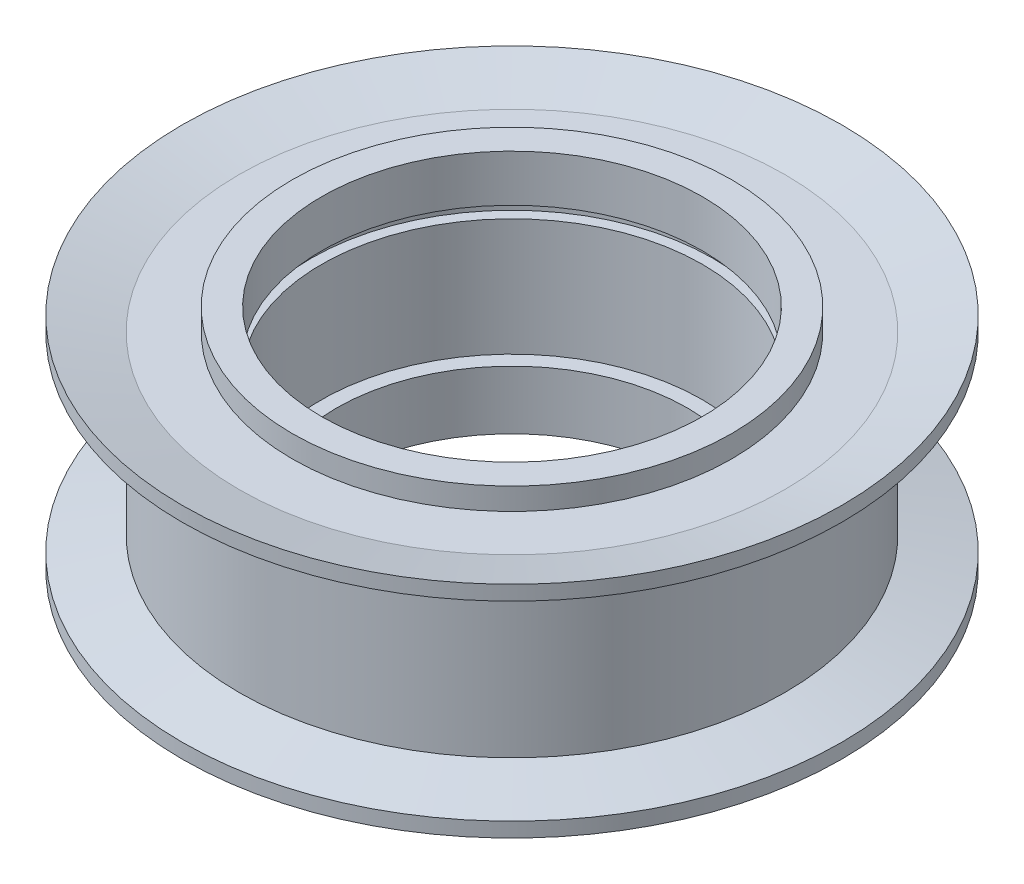
ISO-10303-21;
HEADER;
FILE_DESCRIPTION(('STEP AP214'),'2;1');
FILE_NAME('part.step','',(''),(''),'','','');
FILE_SCHEMA(('AUTOMOTIVE_DESIGN { 1 0 10303 214 1 1 1 1 }'));
ENDSEC;
DATA;
#1=APPLICATION_CONTEXT('core data for automotive mechanical design processes');
#2=APPLICATION_PROTOCOL_DEFINITION('international standard','automotive_design',2000,#1);
#3=PRODUCT_CONTEXT('',#1,'mechanical');
#4=PRODUCT('Part','Part','',(#3));
#5=PRODUCT_RELATED_PRODUCT_CATEGORY('part','',(#4));
#6=PRODUCT_DEFINITION_FORMATION('','',#4);
#7=PRODUCT_DEFINITION_CONTEXT('part definition',#1,'design');
#8=PRODUCT_DEFINITION('design','',#6,#7);
#9=PRODUCT_DEFINITION_SHAPE('','',#8);
#10=(LENGTH_UNIT() NAMED_UNIT(*) SI_UNIT(.MILLI.,.METRE.));
#11=(NAMED_UNIT(*) PLANE_ANGLE_UNIT() SI_UNIT($,.RADIAN.));
#12=(NAMED_UNIT(*) SI_UNIT($,.STERADIAN.) SOLID_ANGLE_UNIT());
#13=UNCERTAINTY_MEASURE_WITH_UNIT(LENGTH_MEASURE(1.E-05),#10,'distance_accuracy_value','');
#14=(GEOMETRIC_REPRESENTATION_CONTEXT(3) GLOBAL_UNCERTAINTY_ASSIGNED_CONTEXT((#13)) GLOBAL_UNIT_ASSIGNED_CONTEXT((#10,
#11,#12)) REPRESENTATION_CONTEXT('',''));
#15=CARTESIAN_POINT('',(0.,0.,0.));
#16=DIRECTION('',(0.,0.,1.));
#17=DIRECTION('',(1.,0.,0.));
#18=AXIS2_PLACEMENT_3D('',#15,#16,#17);
#19=CARTESIAN_POINT('',(0.,49.340027700831,0.));
#20=DIRECTION('',(0.,1.,0.));
#21=DIRECTION('',(0.,0.,1.));
#22=AXIS2_PLACEMENT_3D('',#19,#20,#21);
#23=CYLINDRICAL_SURFACE('',#22,15.);
#24=CARTESIAN_POINT('',(0.,8.,0.));
#25=DIRECTION('',(0.,1.,0.));
#26=DIRECTION('',(0.,0.,1.));
#27=AXIS2_PLACEMENT_3D('',#24,#25,#26);
#28=CIRCLE('',#27,15.);
#29=CARTESIAN_POINT('',(0.,8.,15.));
#30=VERTEX_POINT('',#29);
#31=EDGE_CURVE('E73',#30,#30,#28,.T.);
#32=ORIENTED_EDGE('',*,*,#31,.F.);
#33=EDGE_LOOP('',(#32));
#34=FACE_BOUND('',#33,.T.);
#35=CARTESIAN_POINT('',(0.,6.50000000000001,0.));
#36=DIRECTION('',(0.,-1.,0.));
#37=DIRECTION('',(1.,0.,0.));
#38=AXIS2_PLACEMENT_3D('',#35,#36,#37);
#39=CIRCLE('',#38,15.);
#40=CARTESIAN_POINT('',(15.,6.50000000000001,0.));
#41=VERTEX_POINT('',#40);
#42=EDGE_CURVE('E10',#41,#41,#39,.T.);
#43=ORIENTED_EDGE('',*,*,#42,.F.);
#44=EDGE_LOOP('',(#43));
#45=FACE_BOUND('',#44,.T.);
#46=ADVANCED_FACE('F32',(#34,#45),#23,.T.);
#47=CARTESIAN_POINT('',(0.,49.340027700831,0.));
#48=DIRECTION('',(0.,1.,0.));
#49=DIRECTION('',(0.,0.,1.));
#50=AXIS2_PLACEMENT_3D('',#47,#48,#49);
#51=CYLINDRICAL_SURFACE('',#50,15.);
#52=CARTESIAN_POINT('',(0.,-8.,0.));
#53=DIRECTION('',(0.,1.,0.));
#54=DIRECTION('',(0.,0.,1.));
#55=AXIS2_PLACEMENT_3D('',#52,#53,#54);
#56=CIRCLE('',#55,15.);
#57=CARTESIAN_POINT('',(0.,-8.,15.));
#58=VERTEX_POINT('',#57);
#59=EDGE_CURVE('E67',#58,#58,#56,.T.);
#60=ORIENTED_EDGE('',*,*,#59,.T.);
#61=EDGE_LOOP('',(#60));
#62=FACE_BOUND('',#61,.T.);
#63=CARTESIAN_POINT('',(0.,-6.50000000000001,0.));
#64=DIRECTION('',(0.,1.,0.));
#65=DIRECTION('',(-1.,0.,0.));
#66=AXIS2_PLACEMENT_3D('',#63,#64,#65);
#67=CIRCLE('',#66,15.);
#68=CARTESIAN_POINT('',(-15.,-6.50000000000001,0.));
#69=VERTEX_POINT('',#68);
#70=EDGE_CURVE('E39',#69,#69,#67,.T.);
#71=ORIENTED_EDGE('',*,*,#70,.F.);
#72=EDGE_LOOP('',(#71));
#73=FACE_BOUND('',#72,.T.);
#74=ADVANCED_FACE('F115',(#62,#73),#51,.T.);
#75=CARTESIAN_POINT('',(0.,49.340027700831,0.));
#76=DIRECTION('',(0.,1.,0.));
#77=DIRECTION('',(0.,0.,1.));
#78=AXIS2_PLACEMENT_3D('',#75,#76,#77);
#79=CYLINDRICAL_SURFACE('',#78,13.);
#80=CARTESIAN_POINT('',(0.,4.8,0.));
#81=DIRECTION('',(0.,1.,0.));
#82=DIRECTION('',(0.,0.,1.));
#83=AXIS2_PLACEMENT_3D('',#80,#81,#82);
#84=CIRCLE('',#83,13.);
#85=CARTESIAN_POINT('',(0.,4.8,13.));
#86=VERTEX_POINT('',#85);
#87=EDGE_CURVE('E43',#86,#86,#84,.T.);
#88=ORIENTED_EDGE('',*,*,#87,.F.);
#89=EDGE_LOOP('',(#88));
#90=FACE_BOUND('',#89,.T.);
#91=CARTESIAN_POINT('',(0.,8.,0.));
#92=DIRECTION('',(0.,1.,0.));
#93=DIRECTION('',(0.,0.,1.));
#94=AXIS2_PLACEMENT_3D('',#91,#92,#93);
#95=CIRCLE('',#94,13.);
#96=CARTESIAN_POINT('',(0.,8.,13.));
#97=VERTEX_POINT('',#96);
#98=EDGE_CURVE('E76',#97,#97,#95,.T.);
#99=ORIENTED_EDGE('',*,*,#98,.T.);
#100=EDGE_LOOP('',(#99));
#101=FACE_BOUND('',#100,.T.);
#102=ADVANCED_FACE('F34',(#90,#101),#79,.F.);
#103=CARTESIAN_POINT('',(13.,4.8,0.));
#104=DIRECTION('',(0.,1.,0.));
#105=DIRECTION('',(0.,0.,1.));
#106=AXIS2_PLACEMENT_3D('',#103,#104,#105);
#107=PLANE('',#106);
#108=CARTESIAN_POINT('',(0.,4.8,0.));
#109=DIRECTION('',(0.,1.,0.));
#110=DIRECTION('',(0.,0.,1.));
#111=AXIS2_PLACEMENT_3D('',#108,#109,#110);
#112=CIRCLE('',#111,13.7129491325254);
#113=CARTESIAN_POINT('',(0.,4.8,13.7129491325254));
#114=VERTEX_POINT('',#113);
#115=EDGE_CURVE('E47',#114,#114,#112,.T.);
#116=ORIENTED_EDGE('',*,*,#115,.F.);
#117=EDGE_LOOP('',(#116));
#118=FACE_BOUND('',#117,.T.);
#119=ORIENTED_EDGE('',*,*,#87,.T.);
#120=EDGE_LOOP('',(#119));
#121=FACE_BOUND('',#120,.T.);
#122=ADVANCED_FACE('F155',(#118,#121),#107,.F.);
#123=CARTESIAN_POINT('',(0.,49.340027700831,0.));
#124=DIRECTION('',(0.,1.,0.));
#125=DIRECTION('',(0.,0.,1.));
#126=AXIS2_PLACEMENT_3D('',#123,#124,#125);
#127=CYLINDRICAL_SURFACE('',#126,13.7129491325254);
#128=CARTESIAN_POINT('',(0.,4.,0.));
#129=DIRECTION('',(0.,1.,0.));
#130=DIRECTION('',(0.,0.,1.));
#131=AXIS2_PLACEMENT_3D('',#128,#129,#130);
#132=CIRCLE('',#131,13.7129491325254);
#133=CARTESIAN_POINT('',(0.,4.,13.7129491325254));
#134=VERTEX_POINT('',#133);
#135=EDGE_CURVE('E52',#134,#134,#132,.T.);
#136=ORIENTED_EDGE('',*,*,#135,.F.);
#137=EDGE_LOOP('',(#136));
#138=FACE_BOUND('',#137,.T.);
#139=ORIENTED_EDGE('',*,*,#115,.T.);
#140=EDGE_LOOP('',(#139));
#141=FACE_BOUND('',#140,.T.);
#142=ADVANCED_FACE('F152',(#138,#141),#127,.F.);
#143=CARTESIAN_POINT('',(13.,4.,0.));
#144=DIRECTION('',(0.,-1.,0.));
#145=DIRECTION('',(0.,0.,-1.));
#146=AXIS2_PLACEMENT_3D('',#143,#144,#145);
#147=PLANE('',#146);
#148=CARTESIAN_POINT('',(0.,4.,0.));
#149=DIRECTION('',(0.,1.,0.));
#150=DIRECTION('',(0.,0.,1.));
#151=AXIS2_PLACEMENT_3D('',#148,#149,#150);
#152=CIRCLE('',#151,13.);
#153=CARTESIAN_POINT('',(0.,4.,13.));
#154=VERTEX_POINT('',#153);
#155=EDGE_CURVE('E55',#154,#154,#152,.T.);
#156=ORIENTED_EDGE('',*,*,#155,.F.);
#157=EDGE_LOOP('',(#156));
#158=FACE_BOUND('',#157,.T.);
#159=ORIENTED_EDGE('',*,*,#135,.T.);
#160=EDGE_LOOP('',(#159));
#161=FACE_BOUND('',#160,.T.);
#162=ADVANCED_FACE('F148',(#158,#161),#147,.F.);
#163=CARTESIAN_POINT('',(0.,49.340027700831,0.));
#164=DIRECTION('',(0.,1.,0.));
#165=DIRECTION('',(0.,0.,1.));
#166=AXIS2_PLACEMENT_3D('',#163,#164,#165);
#167=CYLINDRICAL_SURFACE('',#166,13.);
#168=CARTESIAN_POINT('',(0.,-4.,0.));
#169=DIRECTION('',(0.,1.,0.));
#170=DIRECTION('',(0.,0.,1.));
#171=AXIS2_PLACEMENT_3D('',#168,#169,#170);
#172=CIRCLE('',#171,13.);
#173=CARTESIAN_POINT('',(0.,-4.,13.));
#174=VERTEX_POINT('',#173);
#175=EDGE_CURVE('E58',#174,#174,#172,.T.);
#176=ORIENTED_EDGE('',*,*,#175,.F.);
#177=EDGE_LOOP('',(#176));
#178=FACE_BOUND('',#177,.T.);
#179=ORIENTED_EDGE('',*,*,#155,.T.);
#180=EDGE_LOOP('',(#179));
#181=FACE_BOUND('',#180,.T.);
#182=ADVANCED_FACE('F144',(#178,#181),#167,.F.);
#183=CARTESIAN_POINT('',(12.,-4.,0.));
#184=DIRECTION('',(0.,-1.,0.));
#185=DIRECTION('',(0.,0.,-1.));
#186=AXIS2_PLACEMENT_3D('',#183,#184,#185);
#187=PLANE('',#186);
#188=CARTESIAN_POINT('',(0.,-4.,0.));
#189=DIRECTION('',(0.,1.,0.));
#190=DIRECTION('',(0.,0.,1.));
#191=AXIS2_PLACEMENT_3D('',#188,#189,#190);
#192=CIRCLE('',#191,12.);
#193=CARTESIAN_POINT('',(0.,-4.,12.));
#194=VERTEX_POINT('',#193);
#195=EDGE_CURVE('E61',#194,#194,#192,.T.);
#196=ORIENTED_EDGE('',*,*,#195,.F.);
#197=EDGE_LOOP('',(#196));
#198=FACE_BOUND('',#197,.T.);
#199=ORIENTED_EDGE('',*,*,#175,.T.);
#200=EDGE_LOOP('',(#199));
#201=FACE_BOUND('',#200,.T.);
#202=ADVANCED_FACE('F140',(#198,#201),#187,.F.);
#203=CARTESIAN_POINT('',(0.,49.340027700831,0.));
#204=DIRECTION('',(0.,1.,0.));
#205=DIRECTION('',(0.,0.,1.));
#206=AXIS2_PLACEMENT_3D('',#203,#204,#205);
#207=CYLINDRICAL_SURFACE('',#206,12.);
#208=CARTESIAN_POINT('',(0.,-8.,0.));
#209=DIRECTION('',(0.,1.,0.));
#210=DIRECTION('',(0.,0.,1.));
#211=AXIS2_PLACEMENT_3D('',#208,#209,#210);
#212=CIRCLE('',#211,12.);
#213=CARTESIAN_POINT('',(0.,-8.,12.));
#214=VERTEX_POINT('',#213);
#215=EDGE_CURVE('E64',#214,#214,#212,.T.);
#216=ORIENTED_EDGE('',*,*,#215,.F.);
#217=EDGE_LOOP('',(#216));
#218=FACE_BOUND('',#217,.T.);
#219=ORIENTED_EDGE('',*,*,#195,.T.);
#220=EDGE_LOOP('',(#219));
#221=FACE_BOUND('',#220,.T.);
#222=ADVANCED_FACE('F136',(#218,#221),#207,.F.);
#223=CARTESIAN_POINT('',(15.,-8.,0.));
#224=DIRECTION('',(0.,1.,0.));
#225=DIRECTION('',(0.,0.,1.));
#226=AXIS2_PLACEMENT_3D('',#223,#224,#225);
#227=PLANE('',#226);
#228=ORIENTED_EDGE('',*,*,#59,.F.);
#229=EDGE_LOOP('',(#228));
#230=FACE_BOUND('',#229,.T.);
#231=ORIENTED_EDGE('',*,*,#215,.T.);
#232=EDGE_LOOP('',(#231));
#233=FACE_BOUND('',#232,.T.);
#234=ADVANCED_FACE('F131',(#230,#233),#227,.F.);
#235=CARTESIAN_POINT('',(0.,49.340027700831,0.));
#236=DIRECTION('',(0.,1.,0.));
#237=DIRECTION('',(0.,0.,1.));
#238=AXIS2_PLACEMENT_3D('',#235,#236,#237);
#239=CYLINDRICAL_SURFACE('',#238,18.62);
#240=CARTESIAN_POINT('',(0.,5.5,0.));
#241=DIRECTION('',(0.,1.,0.));
#242=DIRECTION('',(0.,0.,1.));
#243=AXIS2_PLACEMENT_3D('',#240,#241,#242);
#244=CIRCLE('',#243,18.62);
#245=CARTESIAN_POINT('',(0.,5.5,18.62));
#246=VERTEX_POINT('',#245);
#247=EDGE_CURVE('E70',#246,#246,#244,.T.);
#248=ORIENTED_EDGE('',*,*,#247,.F.);
#249=EDGE_LOOP('',(#248));
#250=FACE_BOUND('',#249,.T.);
#251=CARTESIAN_POINT('',(0.,-5.5,0.));
#252=DIRECTION('',(0.,-1.,0.));
#253=DIRECTION('',(1.,0.,0.));
#254=AXIS2_PLACEMENT_3D('',#251,#252,#253);
#255=CIRCLE('',#254,18.62);
#256=CARTESIAN_POINT('',(18.62,-5.5,0.));
#257=VERTEX_POINT('',#256);
#258=EDGE_CURVE('E82',#257,#257,#255,.T.);
#259=ORIENTED_EDGE('',*,*,#258,.F.);
#260=EDGE_LOOP('',(#259));
#261=FACE_BOUND('',#260,.T.);
#262=ADVANCED_FACE('F129',(#250,#261),#239,.T.);
#263=CARTESIAN_POINT('',(15.,8.,0.));
#264=DIRECTION('',(0.,-1.,0.));
#265=DIRECTION('',(0.,0.,-1.));
#266=AXIS2_PLACEMENT_3D('',#263,#264,#265);
#267=PLANE('',#266);
#268=ORIENTED_EDGE('',*,*,#98,.F.);
#269=EDGE_LOOP('',(#268));
#270=FACE_BOUND('',#269,.T.);
#271=ORIENTED_EDGE('',*,*,#31,.T.);
#272=EDGE_LOOP('',(#271));
#273=FACE_BOUND('',#272,.T.);
#274=ADVANCED_FACE('F127',(#270,#273),#267,.F.);
#275=CARTESIAN_POINT('',(0.,0.,0.));
#276=DIRECTION('',(0.,-1.,0.));
#277=DIRECTION('',(1.,0.,0.));
#278=AXIS2_PLACEMENT_3D('',#275,#276,#277);
#279=CYLINDRICAL_SURFACE('',#278,22.5);
#280=CARTESIAN_POINT('',(0.,-7.5,0.));
#281=DIRECTION('',(0.,-1.,0.));
#282=DIRECTION('',(1.,0.,0.));
#283=AXIS2_PLACEMENT_3D('',#280,#281,#282);
#284=CIRCLE('',#283,22.5);
#285=CARTESIAN_POINT('',(22.5,-7.5,0.));
#286=VERTEX_POINT('',#285);
#287=EDGE_CURVE('E88',#286,#286,#284,.T.);
#288=ORIENTED_EDGE('',*,*,#287,.F.);
#289=EDGE_LOOP('',(#288));
#290=FACE_BOUND('',#289,.T.);
#291=CARTESIAN_POINT('',(0.,-6.5,0.));
#292=DIRECTION('',(0.,-1.,0.));
#293=DIRECTION('',(1.,0.,0.));
#294=AXIS2_PLACEMENT_3D('',#291,#292,#293);
#295=CIRCLE('',#294,22.5);
#296=CARTESIAN_POINT('',(22.5,-6.5,0.));
#297=VERTEX_POINT('',#296);
#298=EDGE_CURVE('E79',#297,#297,#295,.T.);
#299=ORIENTED_EDGE('',*,*,#298,.T.);
#300=EDGE_LOOP('',(#299));
#301=FACE_BOUND('',#300,.T.);
#302=ADVANCED_FACE('F171',(#290,#301),#279,.T.);
#303=CARTESIAN_POINT('',(0.,-5.5,0.));
#304=DIRECTION('',(0.,-1.,0.));
#305=DIRECTION('',(1.,0.,0.));
#306=AXIS2_PLACEMENT_3D('',#303,#304,#305);
#307=CONICAL_SURFACE('',#306,18.62,1.31855386890508);
#308=ORIENTED_EDGE('',*,*,#298,.F.);
#309=EDGE_LOOP('',(#308));
#310=FACE_BOUND('',#309,.T.);
#311=ORIENTED_EDGE('',*,*,#258,.T.);
#312=EDGE_LOOP('',(#311));
#313=FACE_BOUND('',#312,.T.);
#314=ADVANCED_FACE('F175',(#310,#313),#307,.T.);
#315=CARTESIAN_POINT('',(-18.62,-6.5,0.));
#316=DIRECTION('',(0.,1.,0.));
#317=DIRECTION('',(-1.,0.,0.));
#318=AXIS2_PLACEMENT_3D('',#315,#316,#317);
#319=PLANE('',#318);
#320=ORIENTED_EDGE('',*,*,#70,.T.);
#321=EDGE_LOOP('',(#320));
#322=FACE_BOUND('',#321,.T.);
#323=CARTESIAN_POINT('',(0.,-6.5,0.));
#324=DIRECTION('',(0.,-1.,0.));
#325=DIRECTION('',(1.,0.,0.));
#326=AXIS2_PLACEMENT_3D('',#323,#324,#325);
#327=CIRCLE('',#326,18.62);
#328=CARTESIAN_POINT('',(18.62,-6.5,0.));
#329=VERTEX_POINT('',#328);
#330=EDGE_CURVE('E85',#329,#329,#327,.T.);
#331=ORIENTED_EDGE('',*,*,#330,.T.);
#332=EDGE_LOOP('',(#331));
#333=FACE_BOUND('',#332,.T.);
#334=ADVANCED_FACE('F180',(#322,#333),#319,.F.);
#335=CARTESIAN_POINT('',(0.,-7.5,0.));
#336=DIRECTION('',(0.,-1.,0.));
#337=DIRECTION('',(1.,0.,0.));
#338=AXIS2_PLACEMENT_3D('',#335,#336,#337);
#339=CONICAL_SURFACE('',#338,22.5,1.31855386890508);
#340=ORIENTED_EDGE('',*,*,#330,.F.);
#341=EDGE_LOOP('',(#340));
#342=FACE_BOUND('',#341,.T.);
#343=ORIENTED_EDGE('',*,*,#287,.T.);
#344=EDGE_LOOP('',(#343));
#345=FACE_BOUND('',#344,.T.);
#346=ADVANCED_FACE('F188',(#342,#345),#339,.F.);
#347=CARTESIAN_POINT('',(0.,0.,0.));
#348=DIRECTION('',(0.,1.,0.));
#349=DIRECTION('',(1.,0.,0.));
#350=AXIS2_PLACEMENT_3D('',#347,#348,#349);
#351=CYLINDRICAL_SURFACE('',#350,22.5);
#352=CARTESIAN_POINT('',(0.,7.5,0.));
#353=DIRECTION('',(0.,-1.,0.));
#354=DIRECTION('',(1.,0.,0.));
#355=AXIS2_PLACEMENT_3D('',#352,#353,#354);
#356=CIRCLE('',#355,22.5);
#357=CARTESIAN_POINT('',(22.5,7.5,0.));
#358=VERTEX_POINT('',#357);
#359=EDGE_CURVE('E97',#358,#358,#356,.T.);
#360=ORIENTED_EDGE('',*,*,#359,.T.);
#361=EDGE_LOOP('',(#360));
#362=FACE_BOUND('',#361,.T.);
#363=CARTESIAN_POINT('',(0.,6.5,0.));
#364=DIRECTION('',(0.,-1.,0.));
#365=DIRECTION('',(1.,0.,0.));
#366=AXIS2_PLACEMENT_3D('',#363,#364,#365);
#367=CIRCLE('',#366,22.5);
#368=CARTESIAN_POINT('',(22.5,6.5,0.));
#369=VERTEX_POINT('',#368);
#370=EDGE_CURVE('E91',#369,#369,#367,.T.);
#371=ORIENTED_EDGE('',*,*,#370,.F.);
#372=EDGE_LOOP('',(#371));
#373=FACE_BOUND('',#372,.T.);
#374=ADVANCED_FACE('F101',(#362,#373),#351,.T.);
#375=CARTESIAN_POINT('',(0.,5.5,0.));
#376=DIRECTION('',(0.,1.,0.));
#377=DIRECTION('',(1.,0.,0.));
#378=AXIS2_PLACEMENT_3D('',#375,#376,#377);
#379=CONICAL_SURFACE('',#378,18.62,1.31855386890508);
#380=ORIENTED_EDGE('',*,*,#370,.T.);
#381=EDGE_LOOP('',(#380));
#382=FACE_BOUND('',#381,.T.);
#383=ORIENTED_EDGE('',*,*,#247,.T.);
#384=EDGE_LOOP('',(#383));
#385=FACE_BOUND('',#384,.T.);
#386=ADVANCED_FACE('F112',(#382,#385),#379,.T.);
#387=CARTESIAN_POINT('',(-18.62,6.5,0.));
#388=DIRECTION('',(0.,-1.,0.));
#389=DIRECTION('',(-1.,0.,0.));
#390=AXIS2_PLACEMENT_3D('',#387,#388,#389);
#391=PLANE('',#390);
#392=ORIENTED_EDGE('',*,*,#42,.T.);
#393=EDGE_LOOP('',(#392));
#394=FACE_BOUND('',#393,.T.);
#395=CARTESIAN_POINT('',(0.,6.5,0.));
#396=DIRECTION('',(0.,-1.,0.));
#397=DIRECTION('',(1.,0.,0.));
#398=AXIS2_PLACEMENT_3D('',#395,#396,#397);
#399=CIRCLE('',#398,18.62);
#400=CARTESIAN_POINT('',(18.62,6.5,0.));
#401=VERTEX_POINT('',#400);
#402=EDGE_CURVE('E94',#401,#401,#399,.T.);
#403=ORIENTED_EDGE('',*,*,#402,.F.);
#404=EDGE_LOOP('',(#403));
#405=FACE_BOUND('',#404,.T.);
#406=ADVANCED_FACE('F106',(#394,#405),#391,.F.);
#407=CARTESIAN_POINT('',(0.,7.5,0.));
#408=DIRECTION('',(0.,1.,0.));
#409=DIRECTION('',(1.,0.,0.));
#410=AXIS2_PLACEMENT_3D('',#407,#408,#409);
#411=CONICAL_SURFACE('',#410,22.5,1.31855386890508);
#412=ORIENTED_EDGE('',*,*,#402,.T.);
#413=EDGE_LOOP('',(#412));
#414=FACE_BOUND('',#413,.T.);
#415=ORIENTED_EDGE('',*,*,#359,.F.);
#416=EDGE_LOOP('',(#415));
#417=FACE_BOUND('',#416,.T.);
#418=ADVANCED_FACE('F104',(#414,#417),#411,.F.);
#419=CLOSED_SHELL('',(#46,#74,#102,#122,#142,#162,#182,#202,#222,#234,#262,#274,#302,#314,#334,
#346,#374,#386,#406,#418));
#420=MANIFOLD_SOLID_BREP('B2',#419);
#421=ADVANCED_BREP_SHAPE_REPRESENTATION('',(#18,#420),#14);
#422=SHAPE_DEFINITION_REPRESENTATION(#9,#421);
ENDSEC;
END-ISO-10303-21;
